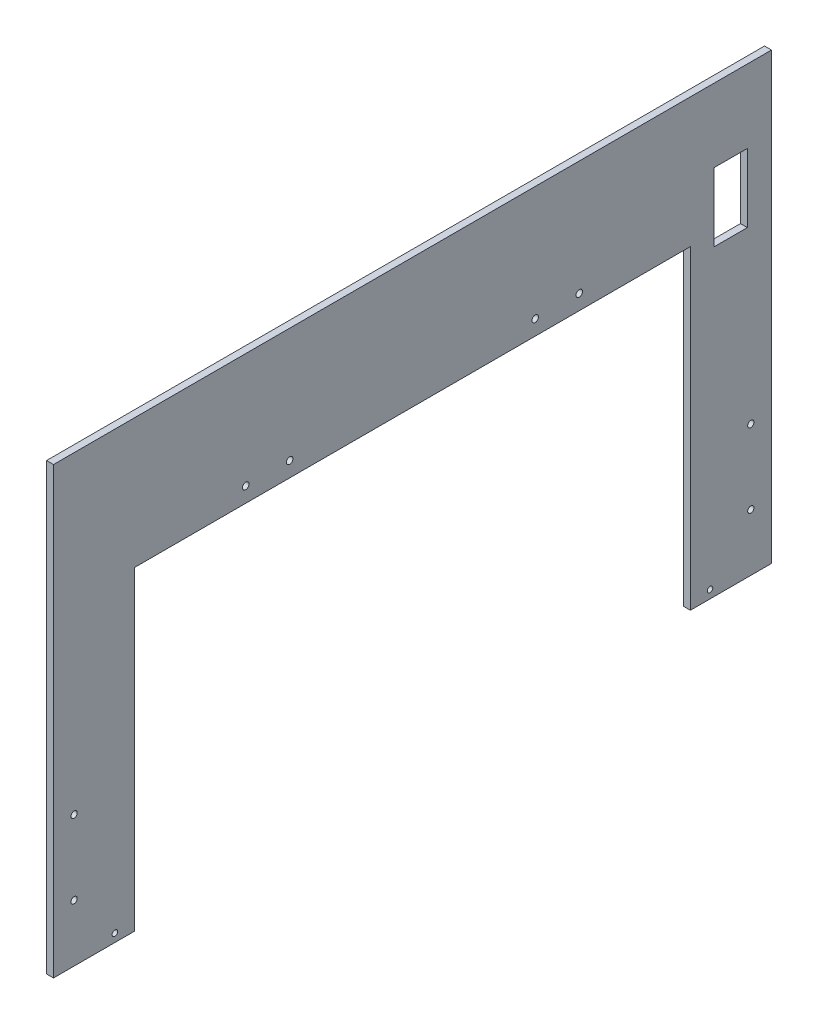
ISO-10303-21;
HEADER;
FILE_DESCRIPTION(('STEP AP214'),'2;1');
FILE_NAME('part.step','',(''),(''),'','','');
FILE_SCHEMA(('AUTOMOTIVE_DESIGN { 1 0 10303 214 1 1 1 1 }'));
ENDSEC;
DATA;
#1=APPLICATION_CONTEXT('core data for automotive mechanical design processes');
#2=APPLICATION_PROTOCOL_DEFINITION('international standard','automotive_design',2000,#1);
#3=PRODUCT_CONTEXT('',#1,'mechanical');
#4=PRODUCT('Part','Part','',(#3));
#5=PRODUCT_RELATED_PRODUCT_CATEGORY('part','',(#4));
#6=PRODUCT_DEFINITION_FORMATION('','',#4);
#7=PRODUCT_DEFINITION_CONTEXT('part definition',#1,'design');
#8=PRODUCT_DEFINITION('design','',#6,#7);
#9=PRODUCT_DEFINITION_SHAPE('','',#8);
#10=(LENGTH_UNIT() NAMED_UNIT(*) SI_UNIT(.MILLI.,.METRE.));
#11=(NAMED_UNIT(*) PLANE_ANGLE_UNIT() SI_UNIT($,.RADIAN.));
#12=(NAMED_UNIT(*) SI_UNIT($,.STERADIAN.) SOLID_ANGLE_UNIT());
#13=UNCERTAINTY_MEASURE_WITH_UNIT(LENGTH_MEASURE(1.E-05),#10,'distance_accuracy_value','');
#14=(GEOMETRIC_REPRESENTATION_CONTEXT(3) GLOBAL_UNCERTAINTY_ASSIGNED_CONTEXT((#13)) GLOBAL_UNIT_ASSIGNED_CONTEXT((#10,
#11,#12)) REPRESENTATION_CONTEXT('',''));
#15=CARTESIAN_POINT('',(0.,0.,0.));
#16=DIRECTION('',(0.,0.,1.));
#17=DIRECTION('',(1.,0.,0.));
#18=AXIS2_PLACEMENT_3D('',#15,#16,#17);
#19=CARTESIAN_POINT('',(4.7625,-152.4,246.0625));
#20=DIRECTION('',(0.,1.,0.));
#21=DIRECTION('',(0.,0.,1.));
#22=AXIS2_PLACEMENT_3D('',#19,#20,#21);
#23=PLANE('',#22);
#24=DIRECTION('',(0.,0.,-1.));
#25=VECTOR('',#24,1.);
#26=CARTESIAN_POINT('',(0.,-152.4,246.0625));
#27=LINE('',#26,#25);
#28=CARTESIAN_POINT('',(0.,-152.4,246.0625));
#29=VERTEX_POINT('',#28);
#30=CARTESIAN_POINT('',(0.,-152.4,190.5));
#31=VERTEX_POINT('',#30);
#32=EDGE_CURVE('E236',#29,#31,#27,.T.);
#33=ORIENTED_EDGE('',*,*,#32,.T.);
#34=DIRECTION('',(1.,0.,0.));
#35=VECTOR('',#34,1.);
#36=CARTESIAN_POINT('',(0.,-152.4,190.5));
#37=LINE('',#36,#35);
#38=CARTESIAN_POINT('',(4.7625,-152.4,190.5));
#39=VERTEX_POINT('',#38);
#40=EDGE_CURVE('E196',#31,#39,#37,.T.);
#41=ORIENTED_EDGE('',*,*,#40,.T.);
#42=DIRECTION('',(0.,0.,-1.));
#43=VECTOR('',#42,1.);
#44=CARTESIAN_POINT('',(4.7625,-152.4,246.0625));
#45=LINE('',#44,#43);
#46=CARTESIAN_POINT('',(4.7625,-152.4,246.0625));
#47=VERTEX_POINT('',#46);
#48=EDGE_CURVE('E241',#47,#39,#45,.T.);
#49=ORIENTED_EDGE('',*,*,#48,.F.);
#50=DIRECTION('',(-1.,0.,0.));
#51=VECTOR('',#50,1.);
#52=CARTESIAN_POINT('',(4.7625,-152.4,246.0625));
#53=LINE('',#52,#51);
#54=EDGE_CURVE('E256',#47,#29,#53,.T.);
#55=ORIENTED_EDGE('',*,*,#54,.T.);
#56=EDGE_LOOP('',(#33,#41,#49,#55));
#57=FACE_BOUND('',#56,.T.);
#58=ADVANCED_FACE('F33',(#57),#23,.F.);
#59=CARTESIAN_POINT('',(4.7625,-152.4,-246.0625));
#60=DIRECTION('',(0.,0.,1.));
#61=DIRECTION('',(1.,0.,0.));
#62=AXIS2_PLACEMENT_3D('',#59,#60,#61);
#63=PLANE('',#62);
#64=DIRECTION('',(0.,1.,0.));
#65=VECTOR('',#64,1.);
#66=CARTESIAN_POINT('',(0.,-152.4,-246.0625));
#67=LINE('',#66,#65);
#68=CARTESIAN_POINT('',(0.,-152.4,-246.0625));
#69=VERTEX_POINT('',#68);
#70=CARTESIAN_POINT('',(0.,152.4,-246.0625));
#71=VERTEX_POINT('',#70);
#72=EDGE_CURVE('E231',#69,#71,#67,.T.);
#73=ORIENTED_EDGE('',*,*,#72,.T.);
#74=DIRECTION('',(-1.,0.,0.));
#75=VECTOR('',#74,1.);
#76=CARTESIAN_POINT('',(4.7625,152.4,-246.0625));
#77=LINE('',#76,#75);
#78=CARTESIAN_POINT('',(4.7625,152.4,-246.0625));
#79=VERTEX_POINT('',#78);
#80=EDGE_CURVE('E262',#79,#71,#77,.T.);
#81=ORIENTED_EDGE('',*,*,#80,.F.);
#82=DIRECTION('',(0.,1.,0.));
#83=VECTOR('',#82,1.);
#84=CARTESIAN_POINT('',(4.7625,-152.4,-246.0625));
#85=LINE('',#84,#83);
#86=CARTESIAN_POINT('',(4.7625,-152.4,-246.0625));
#87=VERTEX_POINT('',#86);
#88=EDGE_CURVE('E232',#87,#79,#85,.T.);
#89=ORIENTED_EDGE('',*,*,#88,.F.);
#90=DIRECTION('',(-1.,0.,0.));
#91=VECTOR('',#90,1.);
#92=CARTESIAN_POINT('',(4.7625,-152.4,-246.0625));
#93=LINE('',#92,#91);
#94=EDGE_CURVE('E244',#87,#69,#93,.T.);
#95=ORIENTED_EDGE('',*,*,#94,.T.);
#96=EDGE_LOOP('',(#73,#81,#89,#95));
#97=FACE_BOUND('',#96,.T.);
#98=ADVANCED_FACE('F35',(#97),#63,.F.);
#99=CARTESIAN_POINT('',(4.7625,152.4,246.0625));
#100=DIRECTION('',(0.,-1.,0.));
#101=DIRECTION('',(0.,0.,-1.));
#102=AXIS2_PLACEMENT_3D('',#99,#100,#101);
#103=PLANE('',#102);
#104=DIRECTION('',(0.,0.,1.));
#105=VECTOR('',#104,1.);
#106=CARTESIAN_POINT('',(0.,152.4,246.0625));
#107=LINE('',#106,#105);
#108=CARTESIAN_POINT('',(0.,152.4,246.0625));
#109=VERTEX_POINT('',#108);
#110=EDGE_CURVE('E247',#71,#109,#107,.T.);
#111=ORIENTED_EDGE('',*,*,#110,.T.);
#112=DIRECTION('',(-1.,0.,0.));
#113=VECTOR('',#112,1.);
#114=CARTESIAN_POINT('',(4.7625,152.4,246.0625));
#115=LINE('',#114,#113);
#116=CARTESIAN_POINT('',(4.7625,152.4,246.0625));
#117=VERTEX_POINT('',#116);
#118=EDGE_CURVE('E259',#117,#109,#115,.T.);
#119=ORIENTED_EDGE('',*,*,#118,.F.);
#120=DIRECTION('',(0.,0.,1.));
#121=VECTOR('',#120,1.);
#122=CARTESIAN_POINT('',(4.7625,152.4,246.0625));
#123=LINE('',#122,#121);
#124=EDGE_CURVE('E235',#79,#117,#123,.T.);
#125=ORIENTED_EDGE('',*,*,#124,.F.);
#126=ORIENTED_EDGE('',*,*,#80,.T.);
#127=EDGE_LOOP('',(#111,#119,#125,#126));
#128=FACE_BOUND('',#127,.T.);
#129=ADVANCED_FACE('F299',(#128),#103,.F.);
#130=CARTESIAN_POINT('',(4.7625,-152.4,246.0625));
#131=DIRECTION('',(0.,0.,-1.));
#132=DIRECTION('',(-1.,0.,0.));
#133=AXIS2_PLACEMENT_3D('',#130,#131,#132);
#134=PLANE('',#133);
#135=DIRECTION('',(0.,-1.,0.));
#136=VECTOR('',#135,1.);
#137=CARTESIAN_POINT('',(0.,-152.4,246.0625));
#138=LINE('',#137,#136);
#139=EDGE_CURVE('E249',#109,#29,#138,.T.);
#140=ORIENTED_EDGE('',*,*,#139,.T.);
#141=ORIENTED_EDGE('',*,*,#54,.F.);
#142=DIRECTION('',(0.,-1.,0.));
#143=VECTOR('',#142,1.);
#144=CARTESIAN_POINT('',(4.7625,-152.4,246.0625));
#145=LINE('',#144,#143);
#146=EDGE_CURVE('E238',#117,#47,#145,.T.);
#147=ORIENTED_EDGE('',*,*,#146,.F.);
#148=ORIENTED_EDGE('',*,*,#118,.T.);
#149=EDGE_LOOP('',(#140,#141,#147,#148));
#150=FACE_BOUND('',#149,.T.);
#151=ADVANCED_FACE('F304',(#150),#134,.F.);
#152=CARTESIAN_POINT('',(4.7625,-152.4,-190.5));
#153=VERTEX_POINT('',#152);
#154=EDGE_CURVE('E240',#153,#87,#45,.T.);
#155=ORIENTED_EDGE('',*,*,#154,.F.);
#156=DIRECTION('',(1.,0.,0.));
#157=VECTOR('',#156,1.);
#158=CARTESIAN_POINT('',(0.,-152.4,-190.5));
#159=LINE('',#158,#157);
#160=CARTESIAN_POINT('',(0.,-152.4,-190.5));
#161=VERTEX_POINT('',#160);
#162=EDGE_CURVE('E208',#161,#153,#159,.T.);
#163=ORIENTED_EDGE('',*,*,#162,.F.);
#164=EDGE_CURVE('E251',#161,#69,#27,.T.);
#165=ORIENTED_EDGE('',*,*,#164,.T.);
#166=ORIENTED_EDGE('',*,*,#94,.F.);
#167=EDGE_LOOP('',(#155,#163,#165,#166));
#168=FACE_BOUND('',#167,.T.);
#169=ADVANCED_FACE('F295',(#168),#23,.F.);
#170=CARTESIAN_POINT('',(4.7625,0.,0.));
#171=DIRECTION('',(-1.,0.,0.));
#172=DIRECTION('',(0.,0.,1.));
#173=AXIS2_PLACEMENT_3D('',#170,#171,#172);
#174=PLANE('',#173);
#175=DIRECTION('',(0.,0.,1.));
#176=VECTOR('',#175,1.);
#177=CARTESIAN_POINT('',(4.7625,102.235,-206.6925));
#178=LINE('',#177,#176);
#179=CARTESIAN_POINT('',(4.7625,102.235,-229.5525));
#180=VERTEX_POINT('',#179);
#181=CARTESIAN_POINT('',(4.7625,102.235,-206.6925));
#182=VERTEX_POINT('',#181);
#183=EDGE_CURVE('E133',#180,#182,#178,.T.);
#184=ORIENTED_EDGE('',*,*,#183,.F.);
#185=DIRECTION('',(0.,1.,0.));
#186=VECTOR('',#185,1.);
#187=CARTESIAN_POINT('',(4.7625,102.235,-229.5525));
#188=LINE('',#187,#186);
#189=CARTESIAN_POINT('',(4.7625,55.2450000000001,-229.5525));
#190=VERTEX_POINT('',#189);
#191=EDGE_CURVE('E48',#190,#180,#188,.T.);
#192=ORIENTED_EDGE('',*,*,#191,.F.);
#193=DIRECTION('',(0.,0.,-1.));
#194=VECTOR('',#193,1.);
#195=CARTESIAN_POINT('',(4.7625,55.2450000000001,-206.6925));
#196=LINE('',#195,#194);
#197=CARTESIAN_POINT('',(4.7625,55.2450000000001,-206.6925));
#198=VERTEX_POINT('',#197);
#199=EDGE_CURVE('E140',#198,#190,#196,.T.);
#200=ORIENTED_EDGE('',*,*,#199,.F.);
#201=DIRECTION('',(0.,-1.,0.));
#202=VECTOR('',#201,1.);
#203=CARTESIAN_POINT('',(4.7625,102.235,-206.6925));
#204=LINE('',#203,#202);
#205=EDGE_CURVE('E124',#182,#198,#204,.T.);
#206=ORIENTED_EDGE('',*,*,#205,.F.);
#207=EDGE_LOOP('',(#184,#192,#200,#206));
#208=FACE_BOUND('',#207,.T.);
#209=CARTESIAN_POINT('',(4.7625,-146.812,203.97089));
#210=DIRECTION('',(1.,0.,0.));
#211=DIRECTION('',(0.,0.,-1.));
#212=AXIS2_PLACEMENT_3D('',#209,#210,#211);
#213=CIRCLE('',#212,1.89865);
#214=CARTESIAN_POINT('',(4.7625,-146.812,202.07224));
#215=VERTEX_POINT('',#214);
#216=EDGE_CURVE('E147',#215,#215,#213,.T.);
#217=ORIENTED_EDGE('',*,*,#216,.F.);
#218=EDGE_LOOP('',(#217));
#219=FACE_BOUND('',#218,.T.);
#220=CARTESIAN_POINT('',(4.7625,-146.812,-203.97089));
#221=DIRECTION('',(1.,0.,0.));
#222=DIRECTION('',(0.,0.,-1.));
#223=AXIS2_PLACEMENT_3D('',#220,#221,#222);
#224=CIRCLE('',#223,1.89865);
#225=CARTESIAN_POINT('',(4.7625,-146.812,-205.86954));
#226=VERTEX_POINT('',#225);
#227=EDGE_CURVE('E155',#226,#226,#224,.T.);
#228=ORIENTED_EDGE('',*,*,#227,.F.);
#229=EDGE_LOOP('',(#228));
#230=FACE_BOUND('',#229,.T.);
#231=CARTESIAN_POINT('',(4.7625,73.81875,114.3));
#232=DIRECTION('',(1.,0.,0.));
#233=DIRECTION('',(0.,0.,-1.));
#234=AXIS2_PLACEMENT_3D('',#231,#232,#233);
#235=CIRCLE('',#234,2.24789999999998);
#236=CARTESIAN_POINT('',(4.7625,73.81875,112.0521));
#237=VERTEX_POINT('',#236);
#238=EDGE_CURVE('E161',#237,#237,#235,.T.);
#239=ORIENTED_EDGE('',*,*,#238,.F.);
#240=EDGE_LOOP('',(#239));
#241=FACE_BOUND('',#240,.T.);
#242=CARTESIAN_POINT('',(4.7625,73.81875,84.1375));
#243=DIRECTION('',(1.,0.,0.));
#244=DIRECTION('',(0.,0.,-1.));
#245=AXIS2_PLACEMENT_3D('',#242,#243,#244);
#246=CIRCLE('',#245,2.24789999999998);
#247=CARTESIAN_POINT('',(4.7625,73.81875,81.8896));
#248=VERTEX_POINT('',#247);
#249=EDGE_CURVE('E167',#248,#248,#246,.T.);
#250=ORIENTED_EDGE('',*,*,#249,.F.);
#251=EDGE_LOOP('',(#250));
#252=FACE_BOUND('',#251,.T.);
#253=CARTESIAN_POINT('',(4.7625,73.81875,-84.1375));
#254=DIRECTION('',(1.,0.,0.));
#255=DIRECTION('',(0.,0.,-1.));
#256=AXIS2_PLACEMENT_3D('',#253,#254,#255);
#257=CIRCLE('',#256,2.24789999999998);
#258=CARTESIAN_POINT('',(4.7625,73.81875,-86.3854));
#259=VERTEX_POINT('',#258);
#260=EDGE_CURVE('E173',#259,#259,#257,.T.);
#261=ORIENTED_EDGE('',*,*,#260,.F.);
#262=EDGE_LOOP('',(#261));
#263=FACE_BOUND('',#262,.T.);
#264=CARTESIAN_POINT('',(4.7625,73.8187500000001,-114.3));
#265=DIRECTION('',(1.,0.,0.));
#266=DIRECTION('',(0.,0.,-1.));
#267=AXIS2_PLACEMENT_3D('',#264,#265,#266);
#268=CIRCLE('',#267,2.24789999999998);
#269=CARTESIAN_POINT('',(4.7625,73.8187500000001,-116.5479));
#270=VERTEX_POINT('',#269);
#271=EDGE_CURVE('E179',#270,#270,#268,.T.);
#272=ORIENTED_EDGE('',*,*,#271,.F.);
#273=EDGE_LOOP('',(#272));
#274=FACE_BOUND('',#273,.T.);
#275=CARTESIAN_POINT('',(4.7625,-113.284,231.93375));
#276=DIRECTION('',(1.,0.,0.));
#277=DIRECTION('',(0.,0.,-1.));
#278=AXIS2_PLACEMENT_3D('',#275,#276,#277);
#279=CIRCLE('',#278,2.15264999999999);
#280=CARTESIAN_POINT('',(4.7625,-113.284,229.7811));
#281=VERTEX_POINT('',#280);
#282=EDGE_CURVE('E205',#281,#281,#279,.T.);
#283=ORIENTED_EDGE('',*,*,#282,.F.);
#284=EDGE_LOOP('',(#283));
#285=FACE_BOUND('',#284,.T.);
#286=CARTESIAN_POINT('',(4.7625,-62.484,231.93375));
#287=DIRECTION('',(1.,0.,0.));
#288=DIRECTION('',(0.,0.,-1.));
#289=AXIS2_PLACEMENT_3D('',#286,#287,#288);
#290=CIRCLE('',#289,2.15264999999999);
#291=CARTESIAN_POINT('',(4.7625,-62.484,229.7811));
#292=VERTEX_POINT('',#291);
#293=EDGE_CURVE('E215',#292,#292,#290,.T.);
#294=ORIENTED_EDGE('',*,*,#293,.F.);
#295=EDGE_LOOP('',(#294));
#296=FACE_BOUND('',#295,.T.);
#297=CARTESIAN_POINT('',(4.7625,-62.484,-231.93375));
#298=DIRECTION('',(1.,0.,0.));
#299=DIRECTION('',(0.,0.,-1.));
#300=AXIS2_PLACEMENT_3D('',#297,#298,#299);
#301=CIRCLE('',#300,2.15264999999999);
#302=CARTESIAN_POINT('',(4.7625,-62.484,-234.0864));
#303=VERTEX_POINT('',#302);
#304=EDGE_CURVE('E219',#303,#303,#301,.T.);
#305=ORIENTED_EDGE('',*,*,#304,.F.);
#306=EDGE_LOOP('',(#305));
#307=FACE_BOUND('',#306,.T.);
#308=CARTESIAN_POINT('',(4.7625,-113.284,-231.93375));
#309=DIRECTION('',(1.,0.,0.));
#310=DIRECTION('',(0.,0.,-1.));
#311=AXIS2_PLACEMENT_3D('',#308,#309,#310);
#312=CIRCLE('',#311,2.15264999999999);
#313=CARTESIAN_POINT('',(4.7625,-113.284,-234.0864));
#314=VERTEX_POINT('',#313);
#315=EDGE_CURVE('E225',#314,#314,#312,.T.);
#316=ORIENTED_EDGE('',*,*,#315,.F.);
#317=EDGE_LOOP('',(#316));
#318=FACE_BOUND('',#317,.T.);
#319=ORIENTED_EDGE('',*,*,#48,.T.);
#320=DIRECTION('',(0.,-1.,0.));
#321=VECTOR('',#320,1.);
#322=CARTESIAN_POINT('',(4.7625,-152.4,190.5));
#323=LINE('',#322,#321);
#324=CARTESIAN_POINT('',(4.7625,63.5,190.5));
#325=VERTEX_POINT('',#324);
#326=EDGE_CURVE('E185',#325,#39,#323,.T.);
#327=ORIENTED_EDGE('',*,*,#326,.F.);
#328=DIRECTION('',(0.,0.,1.));
#329=VECTOR('',#328,1.);
#330=CARTESIAN_POINT('',(4.7625,63.5,190.5));
#331=LINE('',#330,#329);
#332=CARTESIAN_POINT('',(4.7625,63.5,-190.5));
#333=VERTEX_POINT('',#332);
#334=EDGE_CURVE('E190',#333,#325,#331,.T.);
#335=ORIENTED_EDGE('',*,*,#334,.F.);
#336=DIRECTION('',(0.,1.,0.));
#337=VECTOR('',#336,1.);
#338=CARTESIAN_POINT('',(4.7625,-152.4,-190.5));
#339=LINE('',#338,#337);
#340=EDGE_CURVE('E198',#153,#333,#339,.T.);
#341=ORIENTED_EDGE('',*,*,#340,.F.);
#342=ORIENTED_EDGE('',*,*,#154,.T.);
#343=ORIENTED_EDGE('',*,*,#88,.T.);
#344=ORIENTED_EDGE('',*,*,#124,.T.);
#345=ORIENTED_EDGE('',*,*,#146,.T.);
#346=EDGE_LOOP('',(#319,#327,#335,#341,#342,#343,#344,#345));
#347=FACE_BOUND('',#346,.T.);
#348=ADVANCED_FACE('F137',(#208,#219,#230,#241,#252,#263,#274,#285,#296,#307,#318,#347),#174,.F.);
#349=CARTESIAN_POINT('',(0.,0.,0.));
#350=DIRECTION('',(-1.,0.,0.));
#351=DIRECTION('',(0.,0.,1.));
#352=AXIS2_PLACEMENT_3D('',#349,#350,#351);
#353=PLANE('',#352);
#354=DIRECTION('',(0.,-1.,0.));
#355=VECTOR('',#354,1.);
#356=CARTESIAN_POINT('',(0.,0.,-229.5525));
#357=LINE('',#356,#355);
#358=CARTESIAN_POINT('',(0.,102.235,-229.5525));
#359=VERTEX_POINT('',#358);
#360=CARTESIAN_POINT('',(0.,55.2450000000001,-229.5525));
#361=VERTEX_POINT('',#360);
#362=EDGE_CURVE('E11',#359,#361,#357,.T.);
#363=ORIENTED_EDGE('',*,*,#362,.F.);
#364=DIRECTION('',(0.,0.,-1.));
#365=VECTOR('',#364,1.);
#366=CARTESIAN_POINT('',(0.,102.235,0.));
#367=LINE('',#366,#365);
#368=CARTESIAN_POINT('',(0.,102.235,-206.6925));
#369=VERTEX_POINT('',#368);
#370=EDGE_CURVE('E265',#369,#359,#367,.T.);
#371=ORIENTED_EDGE('',*,*,#370,.F.);
#372=DIRECTION('',(0.,1.,0.));
#373=VECTOR('',#372,1.);
#374=CARTESIAN_POINT('',(0.,0.,-206.6925));
#375=LINE('',#374,#373);
#376=CARTESIAN_POINT('',(0.,55.2450000000001,-206.6925));
#377=VERTEX_POINT('',#376);
#378=EDGE_CURVE('E127',#377,#369,#375,.T.);
#379=ORIENTED_EDGE('',*,*,#378,.F.);
#380=DIRECTION('',(0.,0.,1.));
#381=VECTOR('',#380,1.);
#382=CARTESIAN_POINT('',(0.,55.2450000000001,0.));
#383=LINE('',#382,#381);
#384=EDGE_CURVE('E41',#361,#377,#383,.T.);
#385=ORIENTED_EDGE('',*,*,#384,.F.);
#386=EDGE_LOOP('',(#363,#371,#379,#385));
#387=FACE_BOUND('',#386,.T.);
#388=CARTESIAN_POINT('',(0.,-146.812,203.97089));
#389=DIRECTION('',(-1.,0.,0.));
#390=DIRECTION('',(0.,0.,1.));
#391=AXIS2_PLACEMENT_3D('',#388,#389,#390);
#392=CIRCLE('',#391,1.89864999999999);
#393=CARTESIAN_POINT('',(0.,-146.812,205.86954));
#394=VERTEX_POINT('',#393);
#395=EDGE_CURVE('E152',#394,#394,#392,.T.);
#396=ORIENTED_EDGE('',*,*,#395,.F.);
#397=EDGE_LOOP('',(#396));
#398=FACE_BOUND('',#397,.T.);
#399=CARTESIAN_POINT('',(0.,-146.812,-203.97089));
#400=DIRECTION('',(-1.,0.,0.));
#401=DIRECTION('',(0.,0.,1.));
#402=AXIS2_PLACEMENT_3D('',#399,#400,#401);
#403=CIRCLE('',#402,1.89864999999999);
#404=CARTESIAN_POINT('',(0.,-146.812,-202.07224));
#405=VERTEX_POINT('',#404);
#406=EDGE_CURVE('E158',#405,#405,#403,.T.);
#407=ORIENTED_EDGE('',*,*,#406,.F.);
#408=EDGE_LOOP('',(#407));
#409=FACE_BOUND('',#408,.T.);
#410=CARTESIAN_POINT('',(0.,73.81875,114.3));
#411=DIRECTION('',(-1.,0.,0.));
#412=DIRECTION('',(0.,0.,1.));
#413=AXIS2_PLACEMENT_3D('',#410,#411,#412);
#414=CIRCLE('',#413,2.24789999999998);
#415=CARTESIAN_POINT('',(0.,73.81875,116.5479));
#416=VERTEX_POINT('',#415);
#417=EDGE_CURVE('E164',#416,#416,#414,.T.);
#418=ORIENTED_EDGE('',*,*,#417,.F.);
#419=EDGE_LOOP('',(#418));
#420=FACE_BOUND('',#419,.T.);
#421=CARTESIAN_POINT('',(0.,73.81875,84.1375));
#422=DIRECTION('',(-1.,0.,0.));
#423=DIRECTION('',(0.,0.,1.));
#424=AXIS2_PLACEMENT_3D('',#421,#422,#423);
#425=CIRCLE('',#424,2.24789999999998);
#426=CARTESIAN_POINT('',(0.,73.81875,86.3854));
#427=VERTEX_POINT('',#426);
#428=EDGE_CURVE('E170',#427,#427,#425,.T.);
#429=ORIENTED_EDGE('',*,*,#428,.F.);
#430=EDGE_LOOP('',(#429));
#431=FACE_BOUND('',#430,.T.);
#432=CARTESIAN_POINT('',(0.,73.81875,-84.1375));
#433=DIRECTION('',(-1.,0.,0.));
#434=DIRECTION('',(0.,0.,1.));
#435=AXIS2_PLACEMENT_3D('',#432,#433,#434);
#436=CIRCLE('',#435,2.24789999999998);
#437=CARTESIAN_POINT('',(0.,73.81875,-81.8896));
#438=VERTEX_POINT('',#437);
#439=EDGE_CURVE('E176',#438,#438,#436,.T.);
#440=ORIENTED_EDGE('',*,*,#439,.F.);
#441=EDGE_LOOP('',(#440));
#442=FACE_BOUND('',#441,.T.);
#443=CARTESIAN_POINT('',(0.,73.8187500000001,-114.3));
#444=DIRECTION('',(-1.,0.,0.));
#445=DIRECTION('',(0.,0.,1.));
#446=AXIS2_PLACEMENT_3D('',#443,#444,#445);
#447=CIRCLE('',#446,2.24789999999998);
#448=CARTESIAN_POINT('',(0.,73.8187500000001,-112.0521));
#449=VERTEX_POINT('',#448);
#450=EDGE_CURVE('E182',#449,#449,#447,.T.);
#451=ORIENTED_EDGE('',*,*,#450,.F.);
#452=EDGE_LOOP('',(#451));
#453=FACE_BOUND('',#452,.T.);
#454=DIRECTION('',(0.,-1.,0.));
#455=VECTOR('',#454,1.);
#456=CARTESIAN_POINT('',(0.,-152.4,190.5));
#457=LINE('',#456,#455);
#458=CARTESIAN_POINT('',(0.,63.5,190.5));
#459=VERTEX_POINT('',#458);
#460=EDGE_CURVE('E186',#459,#31,#457,.T.);
#461=ORIENTED_EDGE('',*,*,#460,.T.);
#462=ORIENTED_EDGE('',*,*,#32,.F.);
#463=ORIENTED_EDGE('',*,*,#139,.F.);
#464=ORIENTED_EDGE('',*,*,#110,.F.);
#465=ORIENTED_EDGE('',*,*,#72,.F.);
#466=ORIENTED_EDGE('',*,*,#164,.F.);
#467=DIRECTION('',(0.,1.,0.));
#468=VECTOR('',#467,1.);
#469=CARTESIAN_POINT('',(0.,-152.4,-190.5));
#470=LINE('',#469,#468);
#471=CARTESIAN_POINT('',(0.,63.5,-190.5));
#472=VERTEX_POINT('',#471);
#473=EDGE_CURVE('E189',#161,#472,#470,.T.);
#474=ORIENTED_EDGE('',*,*,#473,.T.);
#475=DIRECTION('',(0.,0.,1.));
#476=VECTOR('',#475,1.);
#477=CARTESIAN_POINT('',(0.,63.5,190.5));
#478=LINE('',#477,#476);
#479=EDGE_CURVE('E193',#472,#459,#478,.T.);
#480=ORIENTED_EDGE('',*,*,#479,.T.);
#481=EDGE_LOOP('',(#461,#462,#463,#464,#465,#466,#474,#480));
#482=FACE_BOUND('',#481,.T.);
#483=CARTESIAN_POINT('',(0.,-113.284,231.93375));
#484=DIRECTION('',(-1.,0.,0.));
#485=DIRECTION('',(0.,0.,1.));
#486=AXIS2_PLACEMENT_3D('',#483,#484,#485);
#487=CIRCLE('',#486,2.15264999999999);
#488=CARTESIAN_POINT('',(0.,-113.284,234.0864));
#489=VERTEX_POINT('',#488);
#490=EDGE_CURVE('E214',#489,#489,#487,.T.);
#491=ORIENTED_EDGE('',*,*,#490,.F.);
#492=EDGE_LOOP('',(#491));
#493=FACE_BOUND('',#492,.T.);
#494=CARTESIAN_POINT('',(0.,-62.484,231.93375));
#495=DIRECTION('',(-1.,0.,0.));
#496=DIRECTION('',(0.,0.,1.));
#497=AXIS2_PLACEMENT_3D('',#494,#495,#496);
#498=CIRCLE('',#497,2.15264999999999);
#499=CARTESIAN_POINT('',(0.,-62.484,234.0864));
#500=VERTEX_POINT('',#499);
#501=EDGE_CURVE('E218',#500,#500,#498,.T.);
#502=ORIENTED_EDGE('',*,*,#501,.F.);
#503=EDGE_LOOP('',(#502));
#504=FACE_BOUND('',#503,.T.);
#505=CARTESIAN_POINT('',(0.,-62.484,-231.93375));
#506=DIRECTION('',(-1.,0.,0.));
#507=DIRECTION('',(0.,0.,1.));
#508=AXIS2_PLACEMENT_3D('',#505,#506,#507);
#509=CIRCLE('',#508,2.15264999999999);
#510=CARTESIAN_POINT('',(0.,-62.484,-229.7811));
#511=VERTEX_POINT('',#510);
#512=EDGE_CURVE('E222',#511,#511,#509,.T.);
#513=ORIENTED_EDGE('',*,*,#512,.F.);
#514=EDGE_LOOP('',(#513));
#515=FACE_BOUND('',#514,.T.);
#516=CARTESIAN_POINT('',(0.,-113.284,-231.93375));
#517=DIRECTION('',(-1.,0.,0.));
#518=DIRECTION('',(0.,0.,1.));
#519=AXIS2_PLACEMENT_3D('',#516,#517,#518);
#520=CIRCLE('',#519,2.15264999999999);
#521=CARTESIAN_POINT('',(0.,-113.284,-229.7811));
#522=VERTEX_POINT('',#521);
#523=EDGE_CURVE('E228',#522,#522,#520,.T.);
#524=ORIENTED_EDGE('',*,*,#523,.F.);
#525=EDGE_LOOP('',(#524));
#526=FACE_BOUND('',#525,.T.);
#527=ADVANCED_FACE('F277',(#387,#398,#409,#420,#431,#442,#453,#482,#493,#504,#515,#526),#353,.T.);
#528=CARTESIAN_POINT('',(4.7625,-113.284,-231.93375));
#529=DIRECTION('',(1.,0.,0.));
#530=DIRECTION('',(0.,0.,-1.));
#531=AXIS2_PLACEMENT_3D('',#528,#529,#530);
#532=CYLINDRICAL_SURFACE('',#531,2.15264999999999);
#533=ORIENTED_EDGE('',*,*,#523,.T.);
#534=EDGE_LOOP('',(#533));
#535=FACE_BOUND('',#534,.T.);
#536=ORIENTED_EDGE('',*,*,#315,.T.);
#537=EDGE_LOOP('',(#536));
#538=FACE_BOUND('',#537,.T.);
#539=ADVANCED_FACE('F363',(#535,#538),#532,.F.);
#540=CARTESIAN_POINT('',(4.7625,-62.484,-231.93375));
#541=DIRECTION('',(1.,0.,0.));
#542=DIRECTION('',(0.,0.,-1.));
#543=AXIS2_PLACEMENT_3D('',#540,#541,#542);
#544=CYLINDRICAL_SURFACE('',#543,2.15264999999999);
#545=ORIENTED_EDGE('',*,*,#512,.T.);
#546=EDGE_LOOP('',(#545));
#547=FACE_BOUND('',#546,.T.);
#548=ORIENTED_EDGE('',*,*,#304,.T.);
#549=EDGE_LOOP('',(#548));
#550=FACE_BOUND('',#549,.T.);
#551=ADVANCED_FACE('F359',(#547,#550),#544,.F.);
#552=CARTESIAN_POINT('',(4.7625,-62.484,231.93375));
#553=DIRECTION('',(1.,0.,0.));
#554=DIRECTION('',(0.,0.,-1.));
#555=AXIS2_PLACEMENT_3D('',#552,#553,#554);
#556=CYLINDRICAL_SURFACE('',#555,2.15264999999999);
#557=ORIENTED_EDGE('',*,*,#501,.T.);
#558=EDGE_LOOP('',(#557));
#559=FACE_BOUND('',#558,.T.);
#560=ORIENTED_EDGE('',*,*,#293,.T.);
#561=EDGE_LOOP('',(#560));
#562=FACE_BOUND('',#561,.T.);
#563=ADVANCED_FACE('F355',(#559,#562),#556,.F.);
#564=CARTESIAN_POINT('',(4.7625,-113.284,231.93375));
#565=DIRECTION('',(1.,0.,0.));
#566=DIRECTION('',(0.,0.,-1.));
#567=AXIS2_PLACEMENT_3D('',#564,#565,#566);
#568=CYLINDRICAL_SURFACE('',#567,2.15264999999999);
#569=ORIENTED_EDGE('',*,*,#490,.T.);
#570=EDGE_LOOP('',(#569));
#571=FACE_BOUND('',#570,.T.);
#572=ORIENTED_EDGE('',*,*,#282,.T.);
#573=EDGE_LOOP('',(#572));
#574=FACE_BOUND('',#573,.T.);
#575=ADVANCED_FACE('F348',(#571,#574),#568,.F.);
#576=CARTESIAN_POINT('',(0.,-152.4,190.5));
#577=DIRECTION('',(0.,0.,1.));
#578=DIRECTION('',(1.,0.,0.));
#579=AXIS2_PLACEMENT_3D('',#576,#577,#578);
#580=PLANE('',#579);
#581=ORIENTED_EDGE('',*,*,#326,.T.);
#582=ORIENTED_EDGE('',*,*,#40,.F.);
#583=ORIENTED_EDGE('',*,*,#460,.F.);
#584=DIRECTION('',(1.,0.,0.));
#585=VECTOR('',#584,1.);
#586=CARTESIAN_POINT('',(0.,63.5,190.5));
#587=LINE('',#586,#585);
#588=EDGE_CURVE('E203',#459,#325,#587,.T.);
#589=ORIENTED_EDGE('',*,*,#588,.T.);
#590=EDGE_LOOP('',(#581,#582,#583,#589));
#591=FACE_BOUND('',#590,.T.);
#592=ADVANCED_FACE('F337',(#591),#580,.F.);
#593=CARTESIAN_POINT('',(0.,63.5,190.5));
#594=DIRECTION('',(0.,1.,0.));
#595=DIRECTION('',(0.,0.,1.));
#596=AXIS2_PLACEMENT_3D('',#593,#594,#595);
#597=PLANE('',#596);
#598=ORIENTED_EDGE('',*,*,#334,.T.);
#599=ORIENTED_EDGE('',*,*,#588,.F.);
#600=ORIENTED_EDGE('',*,*,#479,.F.);
#601=DIRECTION('',(1.,0.,0.));
#602=VECTOR('',#601,1.);
#603=CARTESIAN_POINT('',(0.,63.5,-190.5));
#604=LINE('',#603,#602);
#605=EDGE_CURVE('E206',#472,#333,#604,.T.);
#606=ORIENTED_EDGE('',*,*,#605,.T.);
#607=EDGE_LOOP('',(#598,#599,#600,#606));
#608=FACE_BOUND('',#607,.T.);
#609=ADVANCED_FACE('F339',(#608),#597,.F.);
#610=CARTESIAN_POINT('',(0.,-152.4,-190.5));
#611=DIRECTION('',(0.,0.,-1.));
#612=DIRECTION('',(0.,1.,0.));
#613=AXIS2_PLACEMENT_3D('',#610,#611,#612);
#614=PLANE('',#613);
#615=ORIENTED_EDGE('',*,*,#340,.T.);
#616=ORIENTED_EDGE('',*,*,#605,.F.);
#617=ORIENTED_EDGE('',*,*,#473,.F.);
#618=ORIENTED_EDGE('',*,*,#162,.T.);
#619=EDGE_LOOP('',(#615,#616,#617,#618));
#620=FACE_BOUND('',#619,.T.);
#621=ADVANCED_FACE('F324',(#620),#614,.F.);
#622=CARTESIAN_POINT('',(4.7625,73.8187500000001,-114.3));
#623=DIRECTION('',(1.,0.,0.));
#624=DIRECTION('',(0.,0.,-1.));
#625=AXIS2_PLACEMENT_3D('',#622,#623,#624);
#626=CYLINDRICAL_SURFACE('',#625,2.24789999999998);
#627=ORIENTED_EDGE('',*,*,#450,.T.);
#628=EDGE_LOOP('',(#627));
#629=FACE_BOUND('',#628,.T.);
#630=ORIENTED_EDGE('',*,*,#271,.T.);
#631=EDGE_LOOP('',(#630));
#632=FACE_BOUND('',#631,.T.);
#633=ADVANCED_FACE('F346',(#629,#632),#626,.F.);
#634=CARTESIAN_POINT('',(4.7625,73.81875,-84.1375));
#635=DIRECTION('',(1.,0.,0.));
#636=DIRECTION('',(0.,0.,-1.));
#637=AXIS2_PLACEMENT_3D('',#634,#635,#636);
#638=CYLINDRICAL_SURFACE('',#637,2.24789999999998);
#639=ORIENTED_EDGE('',*,*,#439,.T.);
#640=EDGE_LOOP('',(#639));
#641=FACE_BOUND('',#640,.T.);
#642=ORIENTED_EDGE('',*,*,#260,.T.);
#643=EDGE_LOOP('',(#642));
#644=FACE_BOUND('',#643,.T.);
#645=ADVANCED_FACE('F415',(#641,#644),#638,.F.);
#646=CARTESIAN_POINT('',(4.7625,73.81875,84.1375));
#647=DIRECTION('',(1.,0.,0.));
#648=DIRECTION('',(0.,0.,-1.));
#649=AXIS2_PLACEMENT_3D('',#646,#647,#648);
#650=CYLINDRICAL_SURFACE('',#649,2.24789999999998);
#651=ORIENTED_EDGE('',*,*,#428,.T.);
#652=EDGE_LOOP('',(#651));
#653=FACE_BOUND('',#652,.T.);
#654=ORIENTED_EDGE('',*,*,#249,.T.);
#655=EDGE_LOOP('',(#654));
#656=FACE_BOUND('',#655,.T.);
#657=ADVANCED_FACE('F424',(#653,#656),#650,.F.);
#658=CARTESIAN_POINT('',(4.7625,73.81875,114.3));
#659=DIRECTION('',(1.,0.,0.));
#660=DIRECTION('',(0.,0.,-1.));
#661=AXIS2_PLACEMENT_3D('',#658,#659,#660);
#662=CYLINDRICAL_SURFACE('',#661,2.24789999999998);
#663=ORIENTED_EDGE('',*,*,#417,.T.);
#664=EDGE_LOOP('',(#663));
#665=FACE_BOUND('',#664,.T.);
#666=ORIENTED_EDGE('',*,*,#238,.T.);
#667=EDGE_LOOP('',(#666));
#668=FACE_BOUND('',#667,.T.);
#669=ADVANCED_FACE('F433',(#665,#668),#662,.F.);
#670=CARTESIAN_POINT('',(4.7625,-146.812,-203.97089));
#671=DIRECTION('',(1.,0.,0.));
#672=DIRECTION('',(0.,0.,-1.));
#673=AXIS2_PLACEMENT_3D('',#670,#671,#672);
#674=CYLINDRICAL_SURFACE('',#673,1.89864999999999);
#675=ORIENTED_EDGE('',*,*,#406,.T.);
#676=EDGE_LOOP('',(#675));
#677=FACE_BOUND('',#676,.T.);
#678=ORIENTED_EDGE('',*,*,#227,.T.);
#679=EDGE_LOOP('',(#678));
#680=FACE_BOUND('',#679,.T.);
#681=ADVANCED_FACE('F288',(#677,#680),#674,.F.);
#682=CARTESIAN_POINT('',(4.7625,-146.812,203.97089));
#683=DIRECTION('',(1.,0.,0.));
#684=DIRECTION('',(0.,0.,-1.));
#685=AXIS2_PLACEMENT_3D('',#682,#683,#684);
#686=CYLINDRICAL_SURFACE('',#685,1.89864999999999);
#687=ORIENTED_EDGE('',*,*,#395,.T.);
#688=EDGE_LOOP('',(#687));
#689=FACE_BOUND('',#688,.T.);
#690=ORIENTED_EDGE('',*,*,#216,.T.);
#691=EDGE_LOOP('',(#690));
#692=FACE_BOUND('',#691,.T.);
#693=ADVANCED_FACE('F281',(#689,#692),#686,.F.);
#694=CARTESIAN_POINT('',(-41.9735,102.235,-229.5525));
#695=DIRECTION('',(0.,0.,-1.));
#696=DIRECTION('',(-1.,0.,0.));
#697=AXIS2_PLACEMENT_3D('',#694,#695,#696);
#698=PLANE('',#697);
#699=ORIENTED_EDGE('',*,*,#362,.T.);
#700=DIRECTION('',(1.,0.,0.));
#701=VECTOR('',#700,1.);
#702=CARTESIAN_POINT('',(-41.9735,55.2450000000001,-229.5525));
#703=LINE('',#702,#701);
#704=EDGE_CURVE('E145',#361,#190,#703,.T.);
#705=ORIENTED_EDGE('',*,*,#704,.T.);
#706=ORIENTED_EDGE('',*,*,#191,.T.);
#707=DIRECTION('',(1.,0.,0.));
#708=VECTOR('',#707,1.);
#709=CARTESIAN_POINT('',(-41.9735,102.235,-229.5525));
#710=LINE('',#709,#708);
#711=EDGE_CURVE('E130',#359,#180,#710,.T.);
#712=ORIENTED_EDGE('',*,*,#711,.F.);
#713=EDGE_LOOP('',(#699,#705,#706,#712));
#714=FACE_BOUND('',#713,.T.);
#715=ADVANCED_FACE('F279',(#714),#698,.F.);
#716=CARTESIAN_POINT('',(-41.9735,55.2450000000001,-206.6925));
#717=DIRECTION('',(0.,-1.,0.));
#718=DIRECTION('',(0.,0.,-1.));
#719=AXIS2_PLACEMENT_3D('',#716,#717,#718);
#720=PLANE('',#719);
#721=ORIENTED_EDGE('',*,*,#384,.T.);
#722=DIRECTION('',(1.,0.,0.));
#723=VECTOR('',#722,1.);
#724=CARTESIAN_POINT('',(-41.9735,55.2450000000001,-206.6925));
#725=LINE('',#724,#723);
#726=EDGE_CURVE('E129',#377,#198,#725,.T.);
#727=ORIENTED_EDGE('',*,*,#726,.T.);
#728=ORIENTED_EDGE('',*,*,#199,.T.);
#729=ORIENTED_EDGE('',*,*,#704,.F.);
#730=EDGE_LOOP('',(#721,#727,#728,#729));
#731=FACE_BOUND('',#730,.T.);
#732=ADVANCED_FACE('F274',(#731),#720,.F.);
#733=CARTESIAN_POINT('',(-41.9735,102.235,-206.6925));
#734=DIRECTION('',(0.,0.,1.));
#735=DIRECTION('',(1.,0.,0.));
#736=AXIS2_PLACEMENT_3D('',#733,#734,#735);
#737=PLANE('',#736);
#738=ORIENTED_EDGE('',*,*,#378,.T.);
#739=DIRECTION('',(1.,0.,0.));
#740=VECTOR('',#739,1.);
#741=CARTESIAN_POINT('',(-41.9735,102.235,-206.6925));
#742=LINE('',#741,#740);
#743=EDGE_CURVE('E56',#369,#182,#742,.T.);
#744=ORIENTED_EDGE('',*,*,#743,.T.);
#745=ORIENTED_EDGE('',*,*,#205,.T.);
#746=ORIENTED_EDGE('',*,*,#726,.F.);
#747=EDGE_LOOP('',(#738,#744,#745,#746));
#748=FACE_BOUND('',#747,.T.);
#749=ADVANCED_FACE('F121',(#748),#737,.F.);
#750=CARTESIAN_POINT('',(-41.9735,102.235,-206.6925));
#751=DIRECTION('',(0.,1.,0.));
#752=DIRECTION('',(0.,0.,1.));
#753=AXIS2_PLACEMENT_3D('',#750,#751,#752);
#754=PLANE('',#753);
#755=ORIENTED_EDGE('',*,*,#370,.T.);
#756=ORIENTED_EDGE('',*,*,#711,.T.);
#757=ORIENTED_EDGE('',*,*,#183,.T.);
#758=ORIENTED_EDGE('',*,*,#743,.F.);
#759=EDGE_LOOP('',(#755,#756,#757,#758));
#760=FACE_BOUND('',#759,.T.);
#761=ADVANCED_FACE('F134',(#760),#754,.F.);
#762=CLOSED_SHELL('',(#58,#98,#129,#151,#169,#348,#527,#539,#551,#563,#575,#592,#609,#621,#633,
#645,#657,#669,#681,#693,#715,#732,#749,#761));
#763=MANIFOLD_SOLID_BREP('B2',#762);
#764=ADVANCED_BREP_SHAPE_REPRESENTATION('',(#18,#763),#14);
#765=SHAPE_DEFINITION_REPRESENTATION(#9,#764);
ENDSEC;
END-ISO-10303-21;
